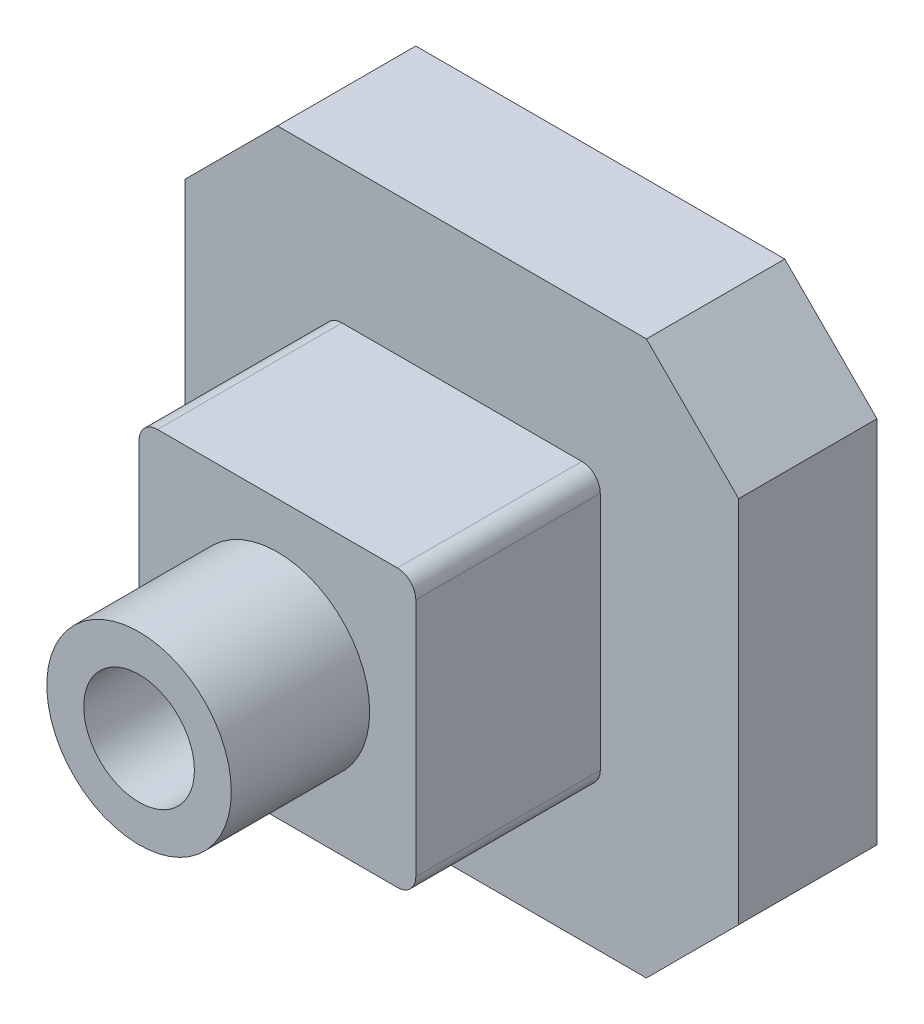
ISO-10303-21;
HEADER;
FILE_DESCRIPTION(('STEP AP214'),'2;1');
FILE_NAME('part.step','',(''),(''),'','','');
FILE_SCHEMA(('AUTOMOTIVE_DESIGN { 1 0 10303 214 1 1 1 1 }'));
ENDSEC;
DATA;
#1=APPLICATION_CONTEXT('core data for automotive mechanical design processes');
#2=APPLICATION_PROTOCOL_DEFINITION('international standard','automotive_design',2000,#1);
#3=PRODUCT_CONTEXT('',#1,'mechanical');
#4=PRODUCT('Part','Part','',(#3));
#5=PRODUCT_RELATED_PRODUCT_CATEGORY('part','',(#4));
#6=PRODUCT_DEFINITION_FORMATION('','',#4);
#7=PRODUCT_DEFINITION_CONTEXT('part definition',#1,'design');
#8=PRODUCT_DEFINITION('design','',#6,#7);
#9=PRODUCT_DEFINITION_SHAPE('','',#8);
#10=(LENGTH_UNIT() NAMED_UNIT(*) SI_UNIT(.MILLI.,.METRE.));
#11=(NAMED_UNIT(*) PLANE_ANGLE_UNIT() SI_UNIT($,.RADIAN.));
#12=(NAMED_UNIT(*) SI_UNIT($,.STERADIAN.) SOLID_ANGLE_UNIT());
#13=UNCERTAINTY_MEASURE_WITH_UNIT(LENGTH_MEASURE(1.E-05),#10,'distance_accuracy_value','');
#14=(GEOMETRIC_REPRESENTATION_CONTEXT(3) GLOBAL_UNCERTAINTY_ASSIGNED_CONTEXT((#13)) GLOBAL_UNIT_ASSIGNED_CONTEXT((#10,
#11,#12)) REPRESENTATION_CONTEXT('',''));
#15=CARTESIAN_POINT('',(0.,0.,0.));
#16=DIRECTION('',(0.,0.,1.));
#17=DIRECTION('',(1.,0.,0.));
#18=AXIS2_PLACEMENT_3D('',#15,#16,#17);
#19=CARTESIAN_POINT('',(0.,0.,0.));
#20=DIRECTION('',(0.,0.,1.));
#21=DIRECTION('',(1.,0.,0.));
#22=AXIS2_PLACEMENT_3D('',#19,#20,#21);
#23=PLANE('',#22);
#24=CARTESIAN_POINT('',(0.,0.,0.));
#25=DIRECTION('',(0.,0.,1.));
#26=DIRECTION('',(1.,0.,0.));
#27=AXIS2_PLACEMENT_3D('',#24,#25,#26);
#28=CIRCLE('',#27,6.);
#29=CARTESIAN_POINT('',(6.,0.,0.));
#30=VERTEX_POINT('',#29);
#31=EDGE_CURVE('E330',#30,#30,#28,.T.);
#32=ORIENTED_EDGE('',*,*,#31,.T.);
#33=EDGE_LOOP('',(#32));
#34=FACE_BOUND('',#33,.T.);
#35=CARTESIAN_POINT('',(0.,0.,0.));
#36=DIRECTION('',(0.,0.,1.));
#37=DIRECTION('',(1.,0.,0.));
#38=AXIS2_PLACEMENT_3D('',#35,#36,#37);
#39=CIRCLE('',#38,9.);
#40=CARTESIAN_POINT('',(9.,0.,0.));
#41=VERTEX_POINT('',#40);
#42=EDGE_CURVE('E323',#41,#41,#39,.T.);
#43=ORIENTED_EDGE('',*,*,#42,.F.);
#44=EDGE_LOOP('',(#43));
#45=FACE_BOUND('',#44,.T.);
#46=ADVANCED_FACE('F51',(#34,#45),#23,.F.);
#47=CARTESIAN_POINT('',(-4.92661467177413E-13,0.,14.9999999999999));
#48=DIRECTION('',(0.,0.,1.));
#49=DIRECTION('',(1.,0.,0.));
#50=AXIS2_PLACEMENT_3D('',#47,#48,#49);
#51=PLANE('',#50);
#52=DIRECTION('',(0.,1.,0.));
#53=VECTOR('',#52,1.);
#54=CARTESIAN_POINT('',(30.,30.,14.9999999999999));
#55=LINE('',#54,#53);
#56=CARTESIAN_POINT('',(30.,-20.,14.9999999999999));
#57=VERTEX_POINT('',#56);
#58=CARTESIAN_POINT('',(30.,19.9999999999999,14.9999999999999));
#59=VERTEX_POINT('',#58);
#60=EDGE_CURVE('E365',#57,#59,#55,.T.);
#61=ORIENTED_EDGE('',*,*,#60,.T.);
#62=DIRECTION('',(0.707106781186546,-0.707106781186549,0.));
#63=VECTOR('',#62,1.);
#64=CARTESIAN_POINT('',(25.,24.9999999999999,14.9999999999999));
#65=LINE('',#64,#63);
#66=CARTESIAN_POINT('',(19.9999999999999,30.,15.));
#67=VERTEX_POINT('',#66);
#68=EDGE_CURVE('E412',#59,#67,#65,.F.);
#69=ORIENTED_EDGE('',*,*,#68,.T.);
#70=DIRECTION('',(-1.,0.,0.));
#71=VECTOR('',#70,1.);
#72=CARTESIAN_POINT('',(-29.9999999999998,30.,14.9999999999999));
#73=LINE('',#72,#71);
#74=CARTESIAN_POINT('',(-20.,30.,15.));
#75=VERTEX_POINT('',#74);
#76=EDGE_CURVE('E368',#67,#75,#73,.T.);
#77=ORIENTED_EDGE('',*,*,#76,.T.);
#78=DIRECTION('',(0.707106781186549,0.707106781186546,0.));
#79=VECTOR('',#78,1.);
#80=CARTESIAN_POINT('',(-24.9999999999999,25.,14.9999999999999));
#81=LINE('',#80,#79);
#82=CARTESIAN_POINT('',(-30.,20.,15.));
#83=VERTEX_POINT('',#82);
#84=EDGE_CURVE('E406',#75,#83,#81,.F.);
#85=ORIENTED_EDGE('',*,*,#84,.T.);
#86=DIRECTION('',(0.,-1.,0.));
#87=VECTOR('',#86,1.);
#88=CARTESIAN_POINT('',(-29.9999999999998,30.,14.9999999999999));
#89=LINE('',#88,#87);
#90=CARTESIAN_POINT('',(-30.,-20.,14.9999999999999));
#91=VERTEX_POINT('',#90);
#92=EDGE_CURVE('E372',#83,#91,#89,.T.);
#93=ORIENTED_EDGE('',*,*,#92,.T.);
#94=DIRECTION('',(-0.707106781186546,0.707106781186549,0.));
#95=VECTOR('',#94,1.);
#96=CARTESIAN_POINT('',(-25.,-24.9999999999999,14.9999999999999));
#97=LINE('',#96,#95);
#98=CARTESIAN_POINT('',(-20.0000000000003,-30.,14.9999999999999));
#99=VERTEX_POINT('',#98);
#100=EDGE_CURVE('E408',#91,#99,#97,.F.);
#101=ORIENTED_EDGE('',*,*,#100,.T.);
#102=DIRECTION('',(1.,0.,0.));
#103=VECTOR('',#102,1.);
#104=CARTESIAN_POINT('',(-30.,-30.,14.9999999999999));
#105=LINE('',#104,#103);
#106=CARTESIAN_POINT('',(19.9999999999999,-30.,14.9999999999999));
#107=VERTEX_POINT('',#106);
#108=EDGE_CURVE('E375',#99,#107,#105,.T.);
#109=ORIENTED_EDGE('',*,*,#108,.T.);
#110=DIRECTION('',(-0.707106781186549,-0.707106781186546,0.));
#111=VECTOR('',#110,1.);
#112=CARTESIAN_POINT('',(25.,-25.,14.9999999999999));
#113=LINE('',#112,#111);
#114=EDGE_CURVE('E410',#107,#57,#113,.F.);
#115=ORIENTED_EDGE('',*,*,#114,.T.);
#116=EDGE_LOOP('',(#61,#69,#77,#85,#93,#101,#109,#115));
#117=FACE_BOUND('',#116,.T.);
#118=DIRECTION('',(-1.,0.,0.));
#119=VECTOR('',#118,1.);
#120=CARTESIAN_POINT('',(-15.,15.,15.));
#121=LINE('',#120,#119);
#122=CARTESIAN_POINT('',(13.,15.,15.));
#123=VERTEX_POINT('',#122);
#124=CARTESIAN_POINT('',(-13.,15.,14.9999999999999));
#125=VERTEX_POINT('',#124);
#126=EDGE_CURVE('E358',#123,#125,#121,.T.);
#127=ORIENTED_EDGE('',*,*,#126,.F.);
#128=CARTESIAN_POINT('',(13.,13.,15.));
#129=DIRECTION('',(0.,0.,1.));
#130=DIRECTION('',(1.,0.,0.));
#131=AXIS2_PLACEMENT_3D('',#128,#129,#130);
#132=CIRCLE('',#131,2.);
#133=CARTESIAN_POINT('',(15.,13.,14.9999999999999));
#134=VERTEX_POINT('',#133);
#135=EDGE_CURVE('E454',#123,#134,#132,.F.);
#136=ORIENTED_EDGE('',*,*,#135,.T.);
#137=DIRECTION('',(0.,1.,0.));
#138=VECTOR('',#137,1.);
#139=CARTESIAN_POINT('',(15.,15.,14.9999999999999));
#140=LINE('',#139,#138);
#141=CARTESIAN_POINT('',(15.,-13.,14.9999999999999));
#142=VERTEX_POINT('',#141);
#143=EDGE_CURVE('E339',#142,#134,#140,.T.);
#144=ORIENTED_EDGE('',*,*,#143,.F.);
#145=CARTESIAN_POINT('',(13.,-13.,14.9999999999999));
#146=DIRECTION('',(0.,0.,1.));
#147=DIRECTION('',(1.,0.,0.));
#148=AXIS2_PLACEMENT_3D('',#145,#146,#147);
#149=CIRCLE('',#148,2.);
#150=CARTESIAN_POINT('',(13.,-15.,15.));
#151=VERTEX_POINT('',#150);
#152=EDGE_CURVE('E452',#142,#151,#149,.F.);
#153=ORIENTED_EDGE('',*,*,#152,.T.);
#154=DIRECTION('',(1.,0.,0.));
#155=VECTOR('',#154,1.);
#156=CARTESIAN_POINT('',(-15.,-15.,15.));
#157=LINE('',#156,#155);
#158=CARTESIAN_POINT('',(-13.,-15.,14.9999999999999));
#159=VERTEX_POINT('',#158);
#160=EDGE_CURVE('E346',#159,#151,#157,.T.);
#161=ORIENTED_EDGE('',*,*,#160,.F.);
#162=CARTESIAN_POINT('',(-13.,-13.,14.9999999999999));
#163=DIRECTION('',(0.,0.,1.));
#164=DIRECTION('',(1.,0.,0.));
#165=AXIS2_PLACEMENT_3D('',#162,#163,#164);
#166=CIRCLE('',#165,2.);
#167=CARTESIAN_POINT('',(-15.,-13.,15.));
#168=VERTEX_POINT('',#167);
#169=EDGE_CURVE('E13',#159,#168,#166,.F.);
#170=ORIENTED_EDGE('',*,*,#169,.T.);
#171=DIRECTION('',(0.,-1.,0.));
#172=VECTOR('',#171,1.);
#173=CARTESIAN_POINT('',(-15.,15.,15.));
#174=LINE('',#173,#172);
#175=CARTESIAN_POINT('',(-15.0000000000002,13.,14.9999999999999));
#176=VERTEX_POINT('',#175);
#177=EDGE_CURVE('E361',#176,#168,#174,.T.);
#178=ORIENTED_EDGE('',*,*,#177,.F.);
#179=CARTESIAN_POINT('',(-13.0000000000002,13.,15.));
#180=DIRECTION('',(0.,0.,1.));
#181=DIRECTION('',(1.,0.,0.));
#182=AXIS2_PLACEMENT_3D('',#179,#180,#181);
#183=CIRCLE('',#182,2.);
#184=EDGE_CURVE('E59',#176,#125,#183,.F.);
#185=ORIENTED_EDGE('',*,*,#184,.T.);
#186=EDGE_LOOP('',(#127,#136,#144,#153,#161,#170,#178,#185));
#187=FACE_BOUND('',#186,.T.);
#188=ADVANCED_FACE('F456',(#117,#187),#51,.T.);
#189=CARTESIAN_POINT('',(30.,30.,14.9999999999999));
#190=DIRECTION('',(-1.,0.,0.));
#191=DIRECTION('',(0.,-1.,0.));
#192=AXIS2_PLACEMENT_3D('',#189,#190,#191);
#193=PLANE('',#192);
#194=DIRECTION('',(0.,1.,0.));
#195=VECTOR('',#194,1.);
#196=CARTESIAN_POINT('',(30.,30.,-2.46330733588707E-13));
#197=LINE('',#196,#195);
#198=CARTESIAN_POINT('',(29.999999999999,-20.,-2.46330733588707E-13));
#199=VERTEX_POINT('',#198);
#200=CARTESIAN_POINT('',(30.,19.9999999999999,0.));
#201=VERTEX_POINT('',#200);
#202=EDGE_CURVE('E355',#199,#201,#197,.T.);
#203=ORIENTED_EDGE('',*,*,#202,.T.);
#204=DIRECTION('',(0.,0.,1.));
#205=VECTOR('',#204,1.);
#206=CARTESIAN_POINT('',(30.,19.9999999999999,14.9999999999999));
#207=LINE('',#206,#205);
#208=EDGE_CURVE('E404',#201,#59,#207,.T.);
#209=ORIENTED_EDGE('',*,*,#208,.T.);
#210=ORIENTED_EDGE('',*,*,#60,.F.);
#211=DIRECTION('',(0.,0.,-1.));
#212=VECTOR('',#211,1.);
#213=CARTESIAN_POINT('',(30.,-20.,14.9999999999999));
#214=LINE('',#213,#212);
#215=EDGE_CURVE('E401',#57,#199,#214,.T.);
#216=ORIENTED_EDGE('',*,*,#215,.T.);
#217=EDGE_LOOP('',(#203,#209,#210,#216));
#218=FACE_BOUND('',#217,.T.);
#219=ADVANCED_FACE('F506',(#218),#193,.F.);
#220=CARTESIAN_POINT('',(-29.9999999999998,30.,14.9999999999999));
#221=DIRECTION('',(0.,-1.,0.));
#222=DIRECTION('',(0.,0.,-1.));
#223=AXIS2_PLACEMENT_3D('',#220,#221,#222);
#224=PLANE('',#223);
#225=ORIENTED_EDGE('',*,*,#76,.F.);
#226=DIRECTION('',(0.,0.,-1.));
#227=VECTOR('',#226,1.);
#228=CARTESIAN_POINT('',(20.,30.,15.));
#229=LINE('',#228,#227);
#230=CARTESIAN_POINT('',(20.0000000000004,30.,0.));
#231=VERTEX_POINT('',#230);
#232=EDGE_CURVE('E390',#67,#231,#229,.T.);
#233=ORIENTED_EDGE('',*,*,#232,.T.);
#234=DIRECTION('',(-1.,0.,0.));
#235=VECTOR('',#234,1.);
#236=CARTESIAN_POINT('',(-30.,30.,0.));
#237=LINE('',#236,#235);
#238=CARTESIAN_POINT('',(-20.,30.,-2.46330733588707E-13));
#239=VERTEX_POINT('',#238);
#240=EDGE_CURVE('E381',#231,#239,#237,.T.);
#241=ORIENTED_EDGE('',*,*,#240,.T.);
#242=DIRECTION('',(0.,0.,1.));
#243=VECTOR('',#242,1.);
#244=CARTESIAN_POINT('',(-20.,30.,15.));
#245=LINE('',#244,#243);
#246=EDGE_CURVE('E378',#239,#75,#245,.T.);
#247=ORIENTED_EDGE('',*,*,#246,.T.);
#248=EDGE_LOOP('',(#225,#233,#241,#247));
#249=FACE_BOUND('',#248,.T.);
#250=ADVANCED_FACE('F528',(#249),#224,.F.);
#251=CARTESIAN_POINT('',(-29.9999999999998,30.,14.9999999999999));
#252=DIRECTION('',(1.,0.,0.));
#253=DIRECTION('',(0.,1.,0.));
#254=AXIS2_PLACEMENT_3D('',#251,#252,#253);
#255=PLANE('',#254);
#256=DIRECTION('',(0.,-1.,0.));
#257=VECTOR('',#256,1.);
#258=CARTESIAN_POINT('',(-30.,30.,0.));
#259=LINE('',#258,#257);
#260=CARTESIAN_POINT('',(-30.,20.,0.));
#261=VERTEX_POINT('',#260);
#262=CARTESIAN_POINT('',(-30.,-20.,-2.46330733588707E-13));
#263=VERTEX_POINT('',#262);
#264=EDGE_CURVE('E384',#261,#263,#259,.T.);
#265=ORIENTED_EDGE('',*,*,#264,.T.);
#266=DIRECTION('',(0.,0.,1.));
#267=VECTOR('',#266,1.);
#268=CARTESIAN_POINT('',(-30.,-20.,14.9999999999999));
#269=LINE('',#268,#267);
#270=EDGE_CURVE('E422',#263,#91,#269,.T.);
#271=ORIENTED_EDGE('',*,*,#270,.T.);
#272=ORIENTED_EDGE('',*,*,#92,.F.);
#273=DIRECTION('',(0.,0.,-1.));
#274=VECTOR('',#273,1.);
#275=CARTESIAN_POINT('',(-30.,20.,15.));
#276=LINE('',#275,#274);
#277=EDGE_CURVE('E419',#83,#261,#276,.T.);
#278=ORIENTED_EDGE('',*,*,#277,.T.);
#279=EDGE_LOOP('',(#265,#271,#272,#278));
#280=FACE_BOUND('',#279,.T.);
#281=ADVANCED_FACE('F519',(#280),#255,.F.);
#282=CARTESIAN_POINT('',(-30.,-30.,14.9999999999999));
#283=DIRECTION('',(0.,1.,0.));
#284=DIRECTION('',(0.,0.,1.));
#285=AXIS2_PLACEMENT_3D('',#282,#283,#284);
#286=PLANE('',#285);
#287=DIRECTION('',(1.,0.,0.));
#288=VECTOR('',#287,1.);
#289=CARTESIAN_POINT('',(-30.,-30.,0.));
#290=LINE('',#289,#288);
#291=CARTESIAN_POINT('',(-20.0000000000003,-30.,-2.46330733588707E-13));
#292=VERTEX_POINT('',#291);
#293=CARTESIAN_POINT('',(19.9999999999999,-30.,0.));
#294=VERTEX_POINT('',#293);
#295=EDGE_CURVE('E369',#292,#294,#290,.T.);
#296=ORIENTED_EDGE('',*,*,#295,.T.);
#297=DIRECTION('',(0.,0.,1.));
#298=VECTOR('',#297,1.);
#299=CARTESIAN_POINT('',(20.,-30.,14.9999999999999));
#300=LINE('',#299,#298);
#301=EDGE_CURVE('E417',#294,#107,#300,.T.);
#302=ORIENTED_EDGE('',*,*,#301,.T.);
#303=ORIENTED_EDGE('',*,*,#108,.F.);
#304=DIRECTION('',(0.,0.,-1.));
#305=VECTOR('',#304,1.);
#306=CARTESIAN_POINT('',(-20.0000000000002,-30.,14.9999999999999));
#307=LINE('',#306,#305);
#308=EDGE_CURVE('E414',#99,#292,#307,.T.);
#309=ORIENTED_EDGE('',*,*,#308,.T.);
#310=EDGE_LOOP('',(#296,#302,#303,#309));
#311=FACE_BOUND('',#310,.T.);
#312=ADVANCED_FACE('F512',(#311),#286,.F.);
#313=DIRECTION('',(-0.707106781186546,0.707106781186549,0.));
#314=VECTOR('',#313,1.);
#315=CARTESIAN_POINT('',(17.8786796564403,27.8786796564404,0.));
#316=LINE('',#315,#314);
#317=CARTESIAN_POINT('',(18.7573593128807,27.,0.));
#318=VERTEX_POINT('',#317);
#319=CARTESIAN_POINT('',(27.,18.7573593128807,0.));
#320=VERTEX_POINT('',#319);
#321=EDGE_CURVE('E315',#318,#320,#316,.F.);
#322=ORIENTED_EDGE('',*,*,#321,.F.);
#323=DIRECTION('',(-1.,0.,0.));
#324=VECTOR('',#323,1.);
#325=CARTESIAN_POINT('',(-30.,27.,0.));
#326=LINE('',#325,#324);
#327=CARTESIAN_POINT('',(-18.7573593128807,27.,-2.46330733588707E-13));
#328=VERTEX_POINT('',#327);
#329=EDGE_CURVE('E264',#318,#328,#326,.T.);
#330=ORIENTED_EDGE('',*,*,#329,.T.);
#331=DIRECTION('',(-0.707106781186549,-0.707106781186546,0.));
#332=VECTOR('',#331,1.);
#333=CARTESIAN_POINT('',(-27.8786796564404,17.8786796564403,0.));
#334=LINE('',#333,#332);
#335=CARTESIAN_POINT('',(-27.,18.7573593128807,0.));
#336=VERTEX_POINT('',#335);
#337=EDGE_CURVE('E266',#336,#328,#334,.F.);
#338=ORIENTED_EDGE('',*,*,#337,.F.);
#339=DIRECTION('',(0.,-1.,0.));
#340=VECTOR('',#339,1.);
#341=CARTESIAN_POINT('',(-27.,30.,0.));
#342=LINE('',#341,#340);
#343=CARTESIAN_POINT('',(-27.,-18.7573593128807,-2.46330733588707E-13));
#344=VERTEX_POINT('',#343);
#345=EDGE_CURVE('E66',#336,#344,#342,.T.);
#346=ORIENTED_EDGE('',*,*,#345,.T.);
#347=DIRECTION('',(0.707106781186546,-0.707106781186549,0.));
#348=VECTOR('',#347,1.);
#349=CARTESIAN_POINT('',(-17.8786796564404,-27.8786796564404,-2.46330733588707E-13));
#350=LINE('',#349,#348);
#351=CARTESIAN_POINT('',(-18.7573593128807,-27.,-2.46330733588707E-13));
#352=VERTEX_POINT('',#351);
#353=EDGE_CURVE('E269',#352,#344,#350,.F.);
#354=ORIENTED_EDGE('',*,*,#353,.F.);
#355=DIRECTION('',(1.,0.,0.));
#356=VECTOR('',#355,1.);
#357=CARTESIAN_POINT('',(-30.,-27.,0.));
#358=LINE('',#357,#356);
#359=CARTESIAN_POINT('',(18.7573593128807,-27.,0.));
#360=VERTEX_POINT('',#359);
#361=EDGE_CURVE('E316',#352,#360,#358,.T.);
#362=ORIENTED_EDGE('',*,*,#361,.T.);
#363=DIRECTION('',(0.707106781186549,0.707106781186546,0.));
#364=VECTOR('',#363,1.);
#365=CARTESIAN_POINT('',(27.8786796564394,-17.8786796564403,-2.46330733588707E-13));
#366=LINE('',#365,#364);
#367=CARTESIAN_POINT('',(26.999999999999,-18.7573593128807,-2.46330733588707E-13));
#368=VERTEX_POINT('',#367);
#369=EDGE_CURVE('E313',#368,#360,#366,.F.);
#370=ORIENTED_EDGE('',*,*,#369,.F.);
#371=DIRECTION('',(0.,1.,0.));
#372=VECTOR('',#371,1.);
#373=CARTESIAN_POINT('',(27.,30.,0.));
#374=LINE('',#373,#372);
#375=EDGE_CURVE('E310',#368,#320,#374,.T.);
#376=ORIENTED_EDGE('',*,*,#375,.T.);
#377=EDGE_LOOP('',(#322,#330,#338,#346,#354,#362,#370,#376));
#378=FACE_BOUND('',#377,.T.);
#379=ORIENTED_EDGE('',*,*,#240,.F.);
#380=DIRECTION('',(-0.707106781186546,0.707106781186549,0.));
#381=VECTOR('',#380,1.);
#382=CARTESIAN_POINT('',(20.0000000000005,30.,0.));
#383=LINE('',#382,#381);
#384=EDGE_CURVE('E399',#231,#201,#383,.F.);
#385=ORIENTED_EDGE('',*,*,#384,.T.);
#386=ORIENTED_EDGE('',*,*,#202,.F.);
#387=DIRECTION('',(0.707106781186549,0.707106781186546,0.));
#388=VECTOR('',#387,1.);
#389=CARTESIAN_POINT('',(29.999999999999,-20.,-2.46330733588707E-13));
#390=LINE('',#389,#388);
#391=EDGE_CURVE('E397',#199,#294,#390,.F.);
#392=ORIENTED_EDGE('',*,*,#391,.T.);
#393=ORIENTED_EDGE('',*,*,#295,.F.);
#394=DIRECTION('',(0.707106781186546,-0.707106781186549,0.));
#395=VECTOR('',#394,1.);
#396=CARTESIAN_POINT('',(-20.0000000000002,-30.,-2.46330733588707E-13));
#397=LINE('',#396,#395);
#398=EDGE_CURVE('E395',#292,#263,#397,.F.);
#399=ORIENTED_EDGE('',*,*,#398,.T.);
#400=ORIENTED_EDGE('',*,*,#264,.F.);
#401=DIRECTION('',(-0.707106781186549,-0.707106781186546,0.));
#402=VECTOR('',#401,1.);
#403=CARTESIAN_POINT('',(-30.,20.,0.));
#404=LINE('',#403,#402);
#405=EDGE_CURVE('E393',#261,#239,#404,.F.);
#406=ORIENTED_EDGE('',*,*,#405,.T.);
#407=EDGE_LOOP('',(#379,#385,#386,#392,#393,#399,#400,#406));
#408=FACE_BOUND('',#407,.T.);
#409=ADVANCED_FACE('F502',(#378,#408),#23,.F.);
#410=CARTESIAN_POINT('',(15.,15.,35.));
#411=DIRECTION('',(-1.,0.,0.));
#412=DIRECTION('',(0.,-1.,0.));
#413=AXIS2_PLACEMENT_3D('',#410,#411,#412);
#414=PLANE('',#413);
#415=DIRECTION('',(0.,1.,0.));
#416=VECTOR('',#415,1.);
#417=CARTESIAN_POINT('',(15.,15.,35.));
#418=LINE('',#417,#416);
#419=CARTESIAN_POINT('',(15.,-13.,35.));
#420=VERTEX_POINT('',#419);
#421=CARTESIAN_POINT('',(15.,13.,35.));
#422=VERTEX_POINT('',#421);
#423=EDGE_CURVE('E342',#420,#422,#418,.T.);
#424=ORIENTED_EDGE('',*,*,#423,.F.);
#425=DIRECTION('',(0.,0.,-1.));
#426=VECTOR('',#425,1.);
#427=CARTESIAN_POINT('',(15.,-13.,35.));
#428=LINE('',#427,#426);
#429=EDGE_CURVE('E426',#420,#142,#428,.T.);
#430=ORIENTED_EDGE('',*,*,#429,.T.);
#431=ORIENTED_EDGE('',*,*,#143,.T.);
#432=DIRECTION('',(0.,0.,-1.));
#433=VECTOR('',#432,1.);
#434=CARTESIAN_POINT('',(15.,13.,35.));
#435=LINE('',#434,#433);
#436=EDGE_CURVE('E424',#134,#422,#435,.F.);
#437=ORIENTED_EDGE('',*,*,#436,.T.);
#438=EDGE_LOOP('',(#424,#430,#431,#437));
#439=FACE_BOUND('',#438,.T.);
#440=ADVANCED_FACE('F486',(#439),#414,.F.);
#441=CARTESIAN_POINT('',(-15.,15.,35.));
#442=DIRECTION('',(0.,-1.,0.));
#443=DIRECTION('',(0.,0.,-1.));
#444=AXIS2_PLACEMENT_3D('',#441,#442,#443);
#445=PLANE('',#444);
#446=DIRECTION('',(-1.,0.,0.));
#447=VECTOR('',#446,1.);
#448=CARTESIAN_POINT('',(-15.,15.,35.));
#449=LINE('',#448,#447);
#450=CARTESIAN_POINT('',(13.,15.,35.));
#451=VERTEX_POINT('',#450);
#452=CARTESIAN_POINT('',(-13.,15.,35.));
#453=VERTEX_POINT('',#452);
#454=EDGE_CURVE('E345',#451,#453,#449,.T.);
#455=ORIENTED_EDGE('',*,*,#454,.F.);
#456=DIRECTION('',(0.,0.,-1.));
#457=VECTOR('',#456,1.);
#458=CARTESIAN_POINT('',(13.,15.,35.));
#459=LINE('',#458,#457);
#460=EDGE_CURVE('E444',#451,#123,#459,.T.);
#461=ORIENTED_EDGE('',*,*,#460,.T.);
#462=ORIENTED_EDGE('',*,*,#126,.T.);
#463=DIRECTION('',(0.,0.,-1.));
#464=VECTOR('',#463,1.);
#465=CARTESIAN_POINT('',(-13.,15.,35.));
#466=LINE('',#465,#464);
#467=EDGE_CURVE('E442',#125,#453,#466,.F.);
#468=ORIENTED_EDGE('',*,*,#467,.T.);
#469=EDGE_LOOP('',(#455,#461,#462,#468));
#470=FACE_BOUND('',#469,.T.);
#471=ADVANCED_FACE('F462',(#470),#445,.F.);
#472=CARTESIAN_POINT('',(-15.,15.,35.));
#473=DIRECTION('',(1.,0.,0.));
#474=DIRECTION('',(0.,1.,0.));
#475=AXIS2_PLACEMENT_3D('',#472,#473,#474);
#476=PLANE('',#475);
#477=DIRECTION('',(0.,-1.,0.));
#478=VECTOR('',#477,1.);
#479=CARTESIAN_POINT('',(-15.,15.,35.));
#480=LINE('',#479,#478);
#481=CARTESIAN_POINT('',(-15.,13.,35.));
#482=VERTEX_POINT('',#481);
#483=CARTESIAN_POINT('',(-14.9999999999997,-12.9999999999995,34.9999999999995));
#484=VERTEX_POINT('',#483);
#485=EDGE_CURVE('E349',#482,#484,#480,.T.);
#486=ORIENTED_EDGE('',*,*,#485,.F.);
#487=DIRECTION('',(0.,0.,-1.));
#488=VECTOR('',#487,1.);
#489=CARTESIAN_POINT('',(-15.,13.,35.));
#490=LINE('',#489,#488);
#491=EDGE_CURVE('E449',#482,#176,#490,.T.);
#492=ORIENTED_EDGE('',*,*,#491,.T.);
#493=ORIENTED_EDGE('',*,*,#177,.T.);
#494=DIRECTION('',(0.,0.,-1.));
#495=VECTOR('',#494,1.);
#496=CARTESIAN_POINT('',(-14.9999999999997,-12.9999999999995,34.9999999999995));
#497=LINE('',#496,#495);
#498=EDGE_CURVE('E447',#168,#484,#497,.F.);
#499=ORIENTED_EDGE('',*,*,#498,.T.);
#500=EDGE_LOOP('',(#486,#492,#493,#499));
#501=FACE_BOUND('',#500,.T.);
#502=ADVANCED_FACE('F471',(#501),#476,.F.);
#503=CARTESIAN_POINT('',(-15.,-14.9999999999995,34.9999999999995));
#504=DIRECTION('',(0.,1.,0.));
#505=DIRECTION('',(0.,0.,1.));
#506=AXIS2_PLACEMENT_3D('',#503,#504,#505);
#507=PLANE('',#506);
#508=ORIENTED_EDGE('',*,*,#160,.T.);
#509=DIRECTION('',(0.,0.,-1.));
#510=VECTOR('',#509,1.);
#511=CARTESIAN_POINT('',(13.,-15.,35.));
#512=LINE('',#511,#510);
#513=CARTESIAN_POINT('',(13.,-15.,35.));
#514=VERTEX_POINT('',#513);
#515=EDGE_CURVE('E432',#151,#514,#512,.F.);
#516=ORIENTED_EDGE('',*,*,#515,.T.);
#517=DIRECTION('',(1.,0.,0.));
#518=VECTOR('',#517,1.);
#519=CARTESIAN_POINT('',(-15.,-14.9999999999995,34.9999999999995));
#520=LINE('',#519,#518);
#521=CARTESIAN_POINT('',(-13.,-15.,34.9999999999995));
#522=VERTEX_POINT('',#521);
#523=EDGE_CURVE('E352',#522,#514,#520,.T.);
#524=ORIENTED_EDGE('',*,*,#523,.F.);
#525=DIRECTION('',(0.,0.,-1.));
#526=VECTOR('',#525,1.);
#527=CARTESIAN_POINT('',(-13.,-15.,34.9999999999995));
#528=LINE('',#527,#526);
#529=EDGE_CURVE('E429',#522,#159,#528,.T.);
#530=ORIENTED_EDGE('',*,*,#529,.T.);
#531=EDGE_LOOP('',(#508,#516,#524,#530));
#532=FACE_BOUND('',#531,.T.);
#533=ADVANCED_FACE('F478',(#532),#507,.F.);
#534=CARTESIAN_POINT('',(0.,0.,35.));
#535=DIRECTION('',(0.,0.,1.));
#536=DIRECTION('',(1.,0.,0.));
#537=AXIS2_PLACEMENT_3D('',#534,#535,#536);
#538=PLANE('',#537);
#539=CARTESIAN_POINT('',(0.,0.,35.));
#540=DIRECTION('',(0.,0.,1.));
#541=DIRECTION('',(1.,0.,0.));
#542=AXIS2_PLACEMENT_3D('',#539,#540,#541);
#543=CIRCLE('',#542,10.);
#544=CARTESIAN_POINT('',(10.,0.,35.));
#545=VERTEX_POINT('',#544);
#546=EDGE_CURVE('E333',#545,#545,#543,.T.);
#547=ORIENTED_EDGE('',*,*,#546,.F.);
#548=EDGE_LOOP('',(#547));
#549=FACE_BOUND('',#548,.T.);
#550=ORIENTED_EDGE('',*,*,#523,.T.);
#551=CARTESIAN_POINT('',(13.,-13.,35.));
#552=DIRECTION('',(0.,0.,1.));
#553=DIRECTION('',(1.,0.,0.));
#554=AXIS2_PLACEMENT_3D('',#551,#552,#553);
#555=CIRCLE('',#554,2.);
#556=EDGE_CURVE('E440',#514,#420,#555,.T.);
#557=ORIENTED_EDGE('',*,*,#556,.T.);
#558=ORIENTED_EDGE('',*,*,#423,.T.);
#559=CARTESIAN_POINT('',(13.,13.,35.));
#560=DIRECTION('',(0.,0.,1.));
#561=DIRECTION('',(1.,0.,0.));
#562=AXIS2_PLACEMENT_3D('',#559,#560,#561);
#563=CIRCLE('',#562,2.);
#564=EDGE_CURVE('E438',#422,#451,#563,.T.);
#565=ORIENTED_EDGE('',*,*,#564,.T.);
#566=ORIENTED_EDGE('',*,*,#454,.T.);
#567=CARTESIAN_POINT('',(-13.,13.,35.));
#568=DIRECTION('',(0.,0.,1.));
#569=DIRECTION('',(1.,0.,0.));
#570=AXIS2_PLACEMENT_3D('',#567,#568,#569);
#571=CIRCLE('',#570,2.);
#572=EDGE_CURVE('E436',#453,#482,#571,.T.);
#573=ORIENTED_EDGE('',*,*,#572,.T.);
#574=ORIENTED_EDGE('',*,*,#485,.T.);
#575=CARTESIAN_POINT('',(-12.9999999999997,-13.,35.));
#576=DIRECTION('',(0.,0.,1.));
#577=DIRECTION('',(1.,0.,0.));
#578=AXIS2_PLACEMENT_3D('',#575,#576,#577);
#579=CIRCLE('',#578,2.);
#580=EDGE_CURVE('E434',#484,#522,#579,.T.);
#581=ORIENTED_EDGE('',*,*,#580,.T.);
#582=EDGE_LOOP('',(#550,#557,#558,#565,#566,#573,#574,#581));
#583=FACE_BOUND('',#582,.T.);
#584=ADVANCED_FACE('F468',(#549,#583),#538,.T.);
#585=CARTESIAN_POINT('',(0.,0.,50.));
#586=DIRECTION('',(0.,0.,-1.));
#587=DIRECTION('',(-1.,0.,0.));
#588=AXIS2_PLACEMENT_3D('',#585,#586,#587);
#589=CYLINDRICAL_SURFACE('',#588,10.);
#590=CARTESIAN_POINT('',(0.,0.,50.));
#591=DIRECTION('',(0.,0.,1.));
#592=DIRECTION('',(1.,0.,0.));
#593=AXIS2_PLACEMENT_3D('',#590,#591,#592);
#594=CIRCLE('',#593,10.);
#595=CARTESIAN_POINT('',(10.,0.,50.));
#596=VERTEX_POINT('',#595);
#597=EDGE_CURVE('E336',#596,#596,#594,.T.);
#598=ORIENTED_EDGE('',*,*,#597,.F.);
#599=EDGE_LOOP('',(#598));
#600=FACE_BOUND('',#599,.T.);
#601=ORIENTED_EDGE('',*,*,#546,.T.);
#602=EDGE_LOOP('',(#601));
#603=FACE_BOUND('',#602,.T.);
#604=ADVANCED_FACE('F709',(#600,#603),#589,.T.);
#605=CARTESIAN_POINT('',(0.,0.,50.));
#606=DIRECTION('',(0.,0.,1.));
#607=DIRECTION('',(1.,0.,0.));
#608=AXIS2_PLACEMENT_3D('',#605,#606,#607);
#609=PLANE('',#608);
#610=CARTESIAN_POINT('',(0.,0.,50.));
#611=DIRECTION('',(0.,0.,1.));
#612=DIRECTION('',(1.,0.,0.));
#613=AXIS2_PLACEMENT_3D('',#610,#611,#612);
#614=CIRCLE('',#613,6.);
#615=CARTESIAN_POINT('',(6.,0.,50.));
#616=VERTEX_POINT('',#615);
#617=EDGE_CURVE('E329',#616,#616,#614,.T.);
#618=ORIENTED_EDGE('',*,*,#617,.F.);
#619=EDGE_LOOP('',(#618));
#620=FACE_BOUND('',#619,.T.);
#621=ORIENTED_EDGE('',*,*,#597,.T.);
#622=EDGE_LOOP('',(#621));
#623=FACE_BOUND('',#622,.T.);
#624=ADVANCED_FACE('F561',(#620,#623),#609,.T.);
#625=CARTESIAN_POINT('',(0.,0.,0.));
#626=DIRECTION('',(0.,0.,1.));
#627=DIRECTION('',(1.,0.,0.));
#628=AXIS2_PLACEMENT_3D('',#625,#626,#627);
#629=CYLINDRICAL_SURFACE('',#628,6.);
#630=ORIENTED_EDGE('',*,*,#31,.F.);
#631=EDGE_LOOP('',(#630));
#632=FACE_BOUND('',#631,.T.);
#633=ORIENTED_EDGE('',*,*,#617,.T.);
#634=EDGE_LOOP('',(#633));
#635=FACE_BOUND('',#634,.T.);
#636=ADVANCED_FACE('F554',(#632,#635),#629,.F.);
#637=CARTESIAN_POINT('',(20.,30.,15.));
#638=DIRECTION('',(-0.707106781186549,-0.707106781186546,0.));
#639=DIRECTION('',(0.,0.,-1.));
#640=AXIS2_PLACEMENT_3D('',#637,#638,#639);
#641=PLANE('',#640);
#642=ORIENTED_EDGE('',*,*,#68,.F.);
#643=ORIENTED_EDGE('',*,*,#208,.F.);
#644=ORIENTED_EDGE('',*,*,#384,.F.);
#645=ORIENTED_EDGE('',*,*,#232,.F.);
#646=EDGE_LOOP('',(#642,#643,#644,#645));
#647=FACE_BOUND('',#646,.T.);
#648=ADVANCED_FACE('F552',(#647),#641,.F.);
#649=CARTESIAN_POINT('',(30.,-20.,14.9999999999999));
#650=DIRECTION('',(-0.707106781186546,0.707106781186549,0.));
#651=DIRECTION('',(0.,0.,-1.));
#652=AXIS2_PLACEMENT_3D('',#649,#650,#651);
#653=PLANE('',#652);
#654=ORIENTED_EDGE('',*,*,#114,.F.);
#655=ORIENTED_EDGE('',*,*,#301,.F.);
#656=ORIENTED_EDGE('',*,*,#391,.F.);
#657=ORIENTED_EDGE('',*,*,#215,.F.);
#658=EDGE_LOOP('',(#654,#655,#656,#657));
#659=FACE_BOUND('',#658,.T.);
#660=ADVANCED_FACE('F545',(#659),#653,.F.);
#661=CARTESIAN_POINT('',(-20.0000000000002,-30.,14.9999999999999));
#662=DIRECTION('',(0.707106781186549,0.707106781186546,0.));
#663=DIRECTION('',(0.,0.,-1.));
#664=AXIS2_PLACEMENT_3D('',#661,#662,#663);
#665=PLANE('',#664);
#666=ORIENTED_EDGE('',*,*,#100,.F.);
#667=ORIENTED_EDGE('',*,*,#270,.F.);
#668=ORIENTED_EDGE('',*,*,#398,.F.);
#669=ORIENTED_EDGE('',*,*,#308,.F.);
#670=EDGE_LOOP('',(#666,#667,#668,#669));
#671=FACE_BOUND('',#670,.T.);
#672=ADVANCED_FACE('F538',(#671),#665,.F.);
#673=CARTESIAN_POINT('',(-30.,20.,15.));
#674=DIRECTION('',(0.707106781186546,-0.707106781186549,0.));
#675=DIRECTION('',(0.,0.,-1.));
#676=AXIS2_PLACEMENT_3D('',#673,#674,#675);
#677=PLANE('',#676);
#678=ORIENTED_EDGE('',*,*,#84,.F.);
#679=ORIENTED_EDGE('',*,*,#246,.F.);
#680=ORIENTED_EDGE('',*,*,#405,.F.);
#681=ORIENTED_EDGE('',*,*,#277,.F.);
#682=EDGE_LOOP('',(#678,#679,#680,#681));
#683=FACE_BOUND('',#682,.T.);
#684=ADVANCED_FACE('F497',(#683),#677,.F.);
#685=CARTESIAN_POINT('',(13.,-13.,35.));
#686=DIRECTION('',(0.,0.,-1.));
#687=DIRECTION('',(-1.,0.,0.));
#688=AXIS2_PLACEMENT_3D('',#685,#686,#687);
#689=CYLINDRICAL_SURFACE('',#688,2.);
#690=ORIENTED_EDGE('',*,*,#556,.F.);
#691=ORIENTED_EDGE('',*,*,#515,.F.);
#692=ORIENTED_EDGE('',*,*,#152,.F.);
#693=ORIENTED_EDGE('',*,*,#429,.F.);
#694=EDGE_LOOP('',(#690,#691,#692,#693));
#695=FACE_BOUND('',#694,.T.);
#696=ADVANCED_FACE('F481',(#695),#689,.T.);
#697=CARTESIAN_POINT('',(13.,13.,35.));
#698=DIRECTION('',(0.,0.,-1.));
#699=DIRECTION('',(-1.,0.,0.));
#700=AXIS2_PLACEMENT_3D('',#697,#698,#699);
#701=CYLINDRICAL_SURFACE('',#700,2.);
#702=ORIENTED_EDGE('',*,*,#564,.F.);
#703=ORIENTED_EDGE('',*,*,#436,.F.);
#704=ORIENTED_EDGE('',*,*,#135,.F.);
#705=ORIENTED_EDGE('',*,*,#460,.F.);
#706=EDGE_LOOP('',(#702,#703,#704,#705));
#707=FACE_BOUND('',#706,.T.);
#708=ADVANCED_FACE('F490',(#707),#701,.T.);
#709=CARTESIAN_POINT('',(-13.,13.,35.));
#710=DIRECTION('',(0.,0.,-1.));
#711=DIRECTION('',(-1.,0.,0.));
#712=AXIS2_PLACEMENT_3D('',#709,#710,#711);
#713=CYLINDRICAL_SURFACE('',#712,2.);
#714=ORIENTED_EDGE('',*,*,#572,.F.);
#715=ORIENTED_EDGE('',*,*,#467,.F.);
#716=ORIENTED_EDGE('',*,*,#184,.F.);
#717=ORIENTED_EDGE('',*,*,#491,.F.);
#718=EDGE_LOOP('',(#714,#715,#716,#717));
#719=FACE_BOUND('',#718,.T.);
#720=ADVANCED_FACE('F465',(#719),#713,.T.);
#721=CARTESIAN_POINT('',(-12.9999999999997,-13.,35.));
#722=DIRECTION('',(0.,0.,-1.));
#723=DIRECTION('',(-1.,0.,0.));
#724=AXIS2_PLACEMENT_3D('',#721,#722,#723);
#725=CYLINDRICAL_SURFACE('',#724,2.);
#726=ORIENTED_EDGE('',*,*,#580,.F.);
#727=ORIENTED_EDGE('',*,*,#498,.F.);
#728=ORIENTED_EDGE('',*,*,#169,.F.);
#729=ORIENTED_EDGE('',*,*,#529,.F.);
#730=EDGE_LOOP('',(#726,#727,#728,#729));
#731=FACE_BOUND('',#730,.T.);
#732=ADVANCED_FACE('F53',(#731),#725,.T.);
#733=CARTESIAN_POINT('',(0.,0.,32.));
#734=DIRECTION('',(0.,0.,1.));
#735=DIRECTION('',(1.,0.,0.));
#736=AXIS2_PLACEMENT_3D('',#733,#734,#735);
#737=PLANE('',#736);
#738=DIRECTION('',(1.,0.,0.));
#739=VECTOR('',#738,1.);
#740=CARTESIAN_POINT('',(-15.,-11.9999999999995,31.9999999999995));
#741=LINE('',#740,#739);
#742=CARTESIAN_POINT('',(-12.,-12.,32.));
#743=VERTEX_POINT('',#742);
#744=CARTESIAN_POINT('',(12.,-12.,32.));
#745=VERTEX_POINT('',#744);
#746=EDGE_CURVE('E304',#743,#745,#741,.T.);
#747=ORIENTED_EDGE('',*,*,#746,.F.);
#748=DIRECTION('',(0.,-1.,0.));
#749=VECTOR('',#748,1.);
#750=CARTESIAN_POINT('',(-12.,15.,32.));
#751=LINE('',#750,#749);
#752=CARTESIAN_POINT('',(-12.,12.,32.));
#753=VERTEX_POINT('',#752);
#754=EDGE_CURVE('E298',#753,#743,#751,.T.);
#755=ORIENTED_EDGE('',*,*,#754,.F.);
#756=DIRECTION('',(-1.,0.,0.));
#757=VECTOR('',#756,1.);
#758=CARTESIAN_POINT('',(-15.,12.,32.));
#759=LINE('',#758,#757);
#760=CARTESIAN_POINT('',(12.,12.,32.));
#761=VERTEX_POINT('',#760);
#762=EDGE_CURVE('E288',#761,#753,#759,.T.);
#763=ORIENTED_EDGE('',*,*,#762,.F.);
#764=DIRECTION('',(0.,1.,0.));
#765=VECTOR('',#764,1.);
#766=CARTESIAN_POINT('',(12.,15.,32.));
#767=LINE('',#766,#765);
#768=EDGE_CURVE('E285',#745,#761,#767,.T.);
#769=ORIENTED_EDGE('',*,*,#768,.F.);
#770=EDGE_LOOP('',(#747,#755,#763,#769));
#771=FACE_BOUND('',#770,.T.);
#772=CARTESIAN_POINT('',(0.,0.,32.));
#773=DIRECTION('',(0.,0.,1.));
#774=DIRECTION('',(1.,0.,0.));
#775=AXIS2_PLACEMENT_3D('',#772,#773,#774);
#776=CIRCLE('',#775,9.);
#777=CARTESIAN_POINT('',(9.,0.,32.));
#778=VERTEX_POINT('',#777);
#779=EDGE_CURVE('E307',#778,#778,#776,.F.);
#780=ORIENTED_EDGE('',*,*,#779,.F.);
#781=EDGE_LOOP('',(#780));
#782=FACE_BOUND('',#781,.T.);
#783=ADVANCED_FACE('F590',(#771,#782),#737,.F.);
#784=CARTESIAN_POINT('',(-4.92661467177413E-13,0.,11.9999999999999));
#785=DIRECTION('',(0.,0.,1.));
#786=DIRECTION('',(1.,0.,0.));
#787=AXIS2_PLACEMENT_3D('',#784,#785,#786);
#788=PLANE('',#787);
#789=DIRECTION('',(0.,1.,0.));
#790=VECTOR('',#789,1.);
#791=CARTESIAN_POINT('',(27.,30.,11.9999999999999));
#792=LINE('',#791,#790);
#793=CARTESIAN_POINT('',(26.999999999999,-18.7573593128807,12.));
#794=VERTEX_POINT('',#793);
#795=CARTESIAN_POINT('',(27.,18.7573593128807,11.9999999999999));
#796=VERTEX_POINT('',#795);
#797=EDGE_CURVE('E260',#794,#796,#792,.T.);
#798=ORIENTED_EDGE('',*,*,#797,.F.);
#799=DIRECTION('',(-0.707106781186549,-0.707106781186546,0.));
#800=VECTOR('',#799,1.);
#801=CARTESIAN_POINT('',(22.8786796564403,-22.8786796564404,11.9999999999999));
#802=LINE('',#801,#800);
#803=CARTESIAN_POINT('',(18.7573593128807,-27.,11.9999999999999));
#804=VERTEX_POINT('',#803);
#805=EDGE_CURVE('E248',#804,#794,#802,.F.);
#806=ORIENTED_EDGE('',*,*,#805,.F.);
#807=DIRECTION('',(1.,0.,0.));
#808=VECTOR('',#807,1.);
#809=CARTESIAN_POINT('',(-30.,-27.,11.9999999999999));
#810=LINE('',#809,#808);
#811=CARTESIAN_POINT('',(-18.7573593128807,-27.,11.9999999999999));
#812=VERTEX_POINT('',#811);
#813=EDGE_CURVE('E271',#812,#804,#810,.T.);
#814=ORIENTED_EDGE('',*,*,#813,.F.);
#815=DIRECTION('',(-0.707106781186546,0.707106781186549,0.));
#816=VECTOR('',#815,1.);
#817=CARTESIAN_POINT('',(-22.8786796564404,-22.8786796564403,11.9999999999999));
#818=LINE('',#817,#816);
#819=CARTESIAN_POINT('',(-27.,-18.7573593128807,12.));
#820=VERTEX_POINT('',#819);
#821=EDGE_CURVE('E795',#820,#812,#818,.F.);
#822=ORIENTED_EDGE('',*,*,#821,.F.);
#823=DIRECTION('',(0.,-1.,0.));
#824=VECTOR('',#823,1.);
#825=CARTESIAN_POINT('',(-27.,30.,11.9999999999999));
#826=LINE('',#825,#824);
#827=CARTESIAN_POINT('',(-27.,18.7573593128807,11.9999999999999));
#828=VERTEX_POINT('',#827);
#829=EDGE_CURVE('E259',#828,#820,#826,.T.);
#830=ORIENTED_EDGE('',*,*,#829,.F.);
#831=DIRECTION('',(0.707106781186549,0.707106781186546,0.));
#832=VECTOR('',#831,1.);
#833=CARTESIAN_POINT('',(-22.8786796564403,22.8786796564404,11.9999999999999));
#834=LINE('',#833,#832);
#835=CARTESIAN_POINT('',(-18.7573593128807,27.,12.));
#836=VERTEX_POINT('',#835);
#837=EDGE_CURVE('E256',#836,#828,#834,.F.);
#838=ORIENTED_EDGE('',*,*,#837,.F.);
#839=DIRECTION('',(-1.,0.,0.));
#840=VECTOR('',#839,1.);
#841=CARTESIAN_POINT('',(-30.0000000000003,27.,11.9999999999999));
#842=LINE('',#841,#840);
#843=CARTESIAN_POINT('',(18.7573593128807,27.,11.9999999999999));
#844=VERTEX_POINT('',#843);
#845=EDGE_CURVE('E252',#844,#836,#842,.T.);
#846=ORIENTED_EDGE('',*,*,#845,.F.);
#847=DIRECTION('',(0.707106781186546,-0.707106781186549,0.));
#848=VECTOR('',#847,1.);
#849=CARTESIAN_POINT('',(22.8786796564404,22.8786796564403,12.));
#850=LINE('',#849,#848);
#851=EDGE_CURVE('E236',#796,#844,#850,.F.);
#852=ORIENTED_EDGE('',*,*,#851,.F.);
#853=EDGE_LOOP('',(#798,#806,#814,#822,#830,#838,#846,#852));
#854=FACE_BOUND('',#853,.T.);
#855=DIRECTION('',(-1.,0.,0.));
#856=VECTOR('',#855,1.);
#857=CARTESIAN_POINT('',(-15.,12.,11.9999999999999));
#858=LINE('',#857,#856);
#859=CARTESIAN_POINT('',(12.,12.,11.9999999999999));
#860=VERTEX_POINT('',#859);
#861=CARTESIAN_POINT('',(-12.,12.,12.));
#862=VERTEX_POINT('',#861);
#863=EDGE_CURVE('E806',#860,#862,#858,.T.);
#864=ORIENTED_EDGE('',*,*,#863,.T.);
#865=DIRECTION('',(0.,-1.,0.));
#866=VECTOR('',#865,1.);
#867=CARTESIAN_POINT('',(-12.,15.,11.9999999999999));
#868=LINE('',#867,#866);
#869=CARTESIAN_POINT('',(-12.,-12.,11.9999999999999));
#870=VERTEX_POINT('',#869);
#871=EDGE_CURVE('E808',#862,#870,#868,.T.);
#872=ORIENTED_EDGE('',*,*,#871,.T.);
#873=DIRECTION('',(1.,0.,0.));
#874=VECTOR('',#873,1.);
#875=CARTESIAN_POINT('',(-15.,-12.,12.));
#876=LINE('',#875,#874);
#877=CARTESIAN_POINT('',(12.,-12.,11.9999999999999));
#878=VERTEX_POINT('',#877);
#879=EDGE_CURVE('E289',#870,#878,#876,.T.);
#880=ORIENTED_EDGE('',*,*,#879,.T.);
#881=DIRECTION('',(0.,1.,0.));
#882=VECTOR('',#881,1.);
#883=CARTESIAN_POINT('',(12.,15.,12.));
#884=LINE('',#883,#882);
#885=EDGE_CURVE('E326',#878,#860,#884,.T.);
#886=ORIENTED_EDGE('',*,*,#885,.T.);
#887=EDGE_LOOP('',(#864,#872,#880,#886));
#888=FACE_BOUND('',#887,.T.);
#889=ADVANCED_FACE('F253',(#854,#888),#788,.F.);
#890=CARTESIAN_POINT('',(27.,30.,14.9999999999999));
#891=DIRECTION('',(-1.,0.,0.));
#892=DIRECTION('',(0.,-1.,0.));
#893=AXIS2_PLACEMENT_3D('',#890,#891,#892);
#894=PLANE('',#893);
#895=ORIENTED_EDGE('',*,*,#375,.F.);
#896=DIRECTION('',(0.,0.,1.));
#897=VECTOR('',#896,1.);
#898=CARTESIAN_POINT('',(27.,-18.7573593128807,15.));
#899=LINE('',#898,#897);
#900=EDGE_CURVE('E274',#794,#368,#899,.F.);
#901=ORIENTED_EDGE('',*,*,#900,.F.);
#902=ORIENTED_EDGE('',*,*,#797,.T.);
#903=DIRECTION('',(0.,0.,-1.));
#904=VECTOR('',#903,1.);
#905=CARTESIAN_POINT('',(27.,18.7573593128807,14.9999999999999));
#906=LINE('',#905,#904);
#907=EDGE_CURVE('E243',#320,#796,#906,.F.);
#908=ORIENTED_EDGE('',*,*,#907,.F.);
#909=EDGE_LOOP('',(#895,#901,#902,#908));
#910=FACE_BOUND('',#909,.T.);
#911=ADVANCED_FACE('F600',(#910),#894,.T.);
#912=CARTESIAN_POINT('',(-30.,27.,14.9999999999999));
#913=DIRECTION('',(0.,-1.,0.));
#914=DIRECTION('',(0.,0.,-1.));
#915=AXIS2_PLACEMENT_3D('',#912,#913,#914);
#916=PLANE('',#915);
#917=ORIENTED_EDGE('',*,*,#845,.T.);
#918=DIRECTION('',(0.,0.,-1.));
#919=VECTOR('',#918,1.);
#920=CARTESIAN_POINT('',(-18.7573593128807,27.,15.));
#921=LINE('',#920,#919);
#922=EDGE_CURVE('E267',#328,#836,#921,.F.);
#923=ORIENTED_EDGE('',*,*,#922,.F.);
#924=ORIENTED_EDGE('',*,*,#329,.F.);
#925=DIRECTION('',(0.,0.,1.));
#926=VECTOR('',#925,1.);
#927=CARTESIAN_POINT('',(18.7573593128807,27.,14.9999999999999));
#928=LINE('',#927,#926);
#929=EDGE_CURVE('E240',#844,#318,#928,.F.);
#930=ORIENTED_EDGE('',*,*,#929,.F.);
#931=EDGE_LOOP('',(#917,#923,#924,#930));
#932=FACE_BOUND('',#931,.T.);
#933=ADVANCED_FACE('F262',(#932),#916,.T.);
#934=CARTESIAN_POINT('',(-26.9999999999998,30.,14.9999999999999));
#935=DIRECTION('',(1.,0.,0.));
#936=DIRECTION('',(0.,1.,0.));
#937=AXIS2_PLACEMENT_3D('',#934,#935,#936);
#938=PLANE('',#937);
#939=ORIENTED_EDGE('',*,*,#345,.F.);
#940=DIRECTION('',(0.,0.,1.));
#941=VECTOR('',#940,1.);
#942=CARTESIAN_POINT('',(-27.,18.7573593128807,14.9999999999999));
#943=LINE('',#942,#941);
#944=EDGE_CURVE('E277',#828,#336,#943,.F.);
#945=ORIENTED_EDGE('',*,*,#944,.F.);
#946=ORIENTED_EDGE('',*,*,#829,.T.);
#947=DIRECTION('',(0.,0.,-1.));
#948=VECTOR('',#947,1.);
#949=CARTESIAN_POINT('',(-27.,-18.7573593128807,15.));
#950=LINE('',#949,#948);
#951=EDGE_CURVE('E279',#344,#820,#950,.F.);
#952=ORIENTED_EDGE('',*,*,#951,.F.);
#953=EDGE_LOOP('',(#939,#945,#946,#952));
#954=FACE_BOUND('',#953,.T.);
#955=ADVANCED_FACE('F614',(#954),#938,.T.);
#956=CARTESIAN_POINT('',(-30.,-27.,14.9999999999999));
#957=DIRECTION('',(0.,1.,0.));
#958=DIRECTION('',(0.,0.,1.));
#959=AXIS2_PLACEMENT_3D('',#956,#957,#958);
#960=PLANE('',#959);
#961=ORIENTED_EDGE('',*,*,#361,.F.);
#962=DIRECTION('',(0.,0.,1.));
#963=VECTOR('',#962,1.);
#964=CARTESIAN_POINT('',(-18.7573593128807,-27.,14.9999999999999));
#965=LINE('',#964,#963);
#966=EDGE_CURVE('E247',#812,#352,#965,.F.);
#967=ORIENTED_EDGE('',*,*,#966,.F.);
#968=ORIENTED_EDGE('',*,*,#813,.T.);
#969=DIRECTION('',(0.,0.,-1.));
#970=VECTOR('',#969,1.);
#971=CARTESIAN_POINT('',(18.7573593128807,-27.,14.9999999999999));
#972=LINE('',#971,#970);
#973=EDGE_CURVE('E280',#360,#804,#972,.F.);
#974=ORIENTED_EDGE('',*,*,#973,.F.);
#975=EDGE_LOOP('',(#961,#967,#968,#974));
#976=FACE_BOUND('',#975,.T.);
#977=ADVANCED_FACE('F621',(#976),#960,.T.);
#978=CARTESIAN_POINT('',(12.,15.,35.));
#979=DIRECTION('',(-1.,0.,0.));
#980=DIRECTION('',(0.,-1.,0.));
#981=AXIS2_PLACEMENT_3D('',#978,#979,#980);
#982=PLANE('',#981);
#983=ORIENTED_EDGE('',*,*,#768,.T.);
#984=DIRECTION('',(0.,0.,1.));
#985=VECTOR('',#984,1.);
#986=CARTESIAN_POINT('',(12.,12.,35.));
#987=LINE('',#986,#985);
#988=EDGE_CURVE('E282',#860,#761,#987,.T.);
#989=ORIENTED_EDGE('',*,*,#988,.F.);
#990=ORIENTED_EDGE('',*,*,#885,.F.);
#991=DIRECTION('',(0.,0.,1.));
#992=VECTOR('',#991,1.);
#993=CARTESIAN_POINT('',(12.,-12.,35.));
#994=LINE('',#993,#992);
#995=EDGE_CURVE('E290',#878,#745,#994,.T.);
#996=ORIENTED_EDGE('',*,*,#995,.T.);
#997=EDGE_LOOP('',(#983,#989,#990,#996));
#998=FACE_BOUND('',#997,.T.);
#999=ADVANCED_FACE('F628',(#998),#982,.T.);
#1000=CARTESIAN_POINT('',(-15.,12.,35.));
#1001=DIRECTION('',(0.,-1.,0.));
#1002=DIRECTION('',(0.,0.,-1.));
#1003=AXIS2_PLACEMENT_3D('',#1000,#1001,#1002);
#1004=PLANE('',#1003);
#1005=ORIENTED_EDGE('',*,*,#762,.T.);
#1006=DIRECTION('',(0.,0.,1.));
#1007=VECTOR('',#1006,1.);
#1008=CARTESIAN_POINT('',(-12.,12.,35.));
#1009=LINE('',#1008,#1007);
#1010=EDGE_CURVE('E293',#862,#753,#1009,.T.);
#1011=ORIENTED_EDGE('',*,*,#1010,.F.);
#1012=ORIENTED_EDGE('',*,*,#863,.F.);
#1013=ORIENTED_EDGE('',*,*,#988,.T.);
#1014=EDGE_LOOP('',(#1005,#1011,#1012,#1013));
#1015=FACE_BOUND('',#1014,.T.);
#1016=ADVANCED_FACE('F636',(#1015),#1004,.T.);
#1017=CARTESIAN_POINT('',(-12.,15.,35.));
#1018=DIRECTION('',(1.,0.,0.));
#1019=DIRECTION('',(0.,1.,0.));
#1020=AXIS2_PLACEMENT_3D('',#1017,#1018,#1019);
#1021=PLANE('',#1020);
#1022=ORIENTED_EDGE('',*,*,#754,.T.);
#1023=DIRECTION('',(0.,0.,1.));
#1024=VECTOR('',#1023,1.);
#1025=CARTESIAN_POINT('',(-12.,-12.,35.));
#1026=LINE('',#1025,#1024);
#1027=EDGE_CURVE('E301',#870,#743,#1026,.T.);
#1028=ORIENTED_EDGE('',*,*,#1027,.F.);
#1029=ORIENTED_EDGE('',*,*,#871,.F.);
#1030=ORIENTED_EDGE('',*,*,#1010,.T.);
#1031=EDGE_LOOP('',(#1022,#1028,#1029,#1030));
#1032=FACE_BOUND('',#1031,.T.);
#1033=ADVANCED_FACE('F644',(#1032),#1021,.T.);
#1034=CARTESIAN_POINT('',(-15.,-11.9999999999995,34.9999999999995));
#1035=DIRECTION('',(0.,1.,0.));
#1036=DIRECTION('',(0.,0.,1.));
#1037=AXIS2_PLACEMENT_3D('',#1034,#1035,#1036);
#1038=PLANE('',#1037);
#1039=ORIENTED_EDGE('',*,*,#879,.F.);
#1040=ORIENTED_EDGE('',*,*,#1027,.T.);
#1041=ORIENTED_EDGE('',*,*,#746,.T.);
#1042=ORIENTED_EDGE('',*,*,#995,.F.);
#1043=EDGE_LOOP('',(#1039,#1040,#1041,#1042));
#1044=FACE_BOUND('',#1043,.T.);
#1045=ADVANCED_FACE('F652',(#1044),#1038,.T.);
#1046=CARTESIAN_POINT('',(0.,0.,0.));
#1047=DIRECTION('',(0.,0.,1.));
#1048=DIRECTION('',(1.,0.,0.));
#1049=AXIS2_PLACEMENT_3D('',#1046,#1047,#1048);
#1050=CYLINDRICAL_SURFACE('',#1049,9.);
#1051=ORIENTED_EDGE('',*,*,#779,.T.);
#1052=EDGE_LOOP('',(#1051));
#1053=FACE_BOUND('',#1052,.T.);
#1054=ORIENTED_EDGE('',*,*,#42,.T.);
#1055=EDGE_LOOP('',(#1054));
#1056=FACE_BOUND('',#1055,.T.);
#1057=ADVANCED_FACE('F660',(#1053,#1056),#1050,.T.);
#1058=CARTESIAN_POINT('',(17.8786796564403,27.8786796564404,14.9999999999999));
#1059=DIRECTION('',(-0.707106781186549,-0.707106781186546,0.));
#1060=DIRECTION('',(0.,0.,-1.));
#1061=AXIS2_PLACEMENT_3D('',#1058,#1059,#1060);
#1062=PLANE('',#1061);
#1063=ORIENTED_EDGE('',*,*,#851,.T.);
#1064=ORIENTED_EDGE('',*,*,#929,.T.);
#1065=ORIENTED_EDGE('',*,*,#321,.T.);
#1066=ORIENTED_EDGE('',*,*,#907,.T.);
#1067=EDGE_LOOP('',(#1063,#1064,#1065,#1066));
#1068=FACE_BOUND('',#1067,.T.);
#1069=ADVANCED_FACE('F238',(#1068),#1062,.T.);
#1070=CARTESIAN_POINT('',(27.8786796564403,-17.8786796564403,14.9999999999999));
#1071=DIRECTION('',(-0.707106781186546,0.707106781186549,0.));
#1072=DIRECTION('',(0.,0.,-1.));
#1073=AXIS2_PLACEMENT_3D('',#1070,#1071,#1072);
#1074=PLANE('',#1073);
#1075=ORIENTED_EDGE('',*,*,#805,.T.);
#1076=ORIENTED_EDGE('',*,*,#900,.T.);
#1077=ORIENTED_EDGE('',*,*,#369,.T.);
#1078=ORIENTED_EDGE('',*,*,#973,.T.);
#1079=EDGE_LOOP('',(#1075,#1076,#1077,#1078));
#1080=FACE_BOUND('',#1079,.T.);
#1081=ADVANCED_FACE('F681',(#1080),#1074,.T.);
#1082=CARTESIAN_POINT('',(-17.8786796564404,-27.8786796564404,14.9999999999999));
#1083=DIRECTION('',(0.707106781186549,0.707106781186546,0.));
#1084=DIRECTION('',(0.,0.,-1.));
#1085=AXIS2_PLACEMENT_3D('',#1082,#1083,#1084);
#1086=PLANE('',#1085);
#1087=ORIENTED_EDGE('',*,*,#821,.T.);
#1088=ORIENTED_EDGE('',*,*,#966,.T.);
#1089=ORIENTED_EDGE('',*,*,#353,.T.);
#1090=ORIENTED_EDGE('',*,*,#951,.T.);
#1091=EDGE_LOOP('',(#1087,#1088,#1089,#1090));
#1092=FACE_BOUND('',#1091,.T.);
#1093=ADVANCED_FACE('F688',(#1092),#1086,.T.);
#1094=CARTESIAN_POINT('',(-27.8786796564404,17.8786796564403,15.));
#1095=DIRECTION('',(0.707106781186546,-0.707106781186549,0.));
#1096=DIRECTION('',(0.,0.,-1.));
#1097=AXIS2_PLACEMENT_3D('',#1094,#1095,#1096);
#1098=PLANE('',#1097);
#1099=ORIENTED_EDGE('',*,*,#837,.T.);
#1100=ORIENTED_EDGE('',*,*,#944,.T.);
#1101=ORIENTED_EDGE('',*,*,#337,.T.);
#1102=ORIENTED_EDGE('',*,*,#922,.T.);
#1103=EDGE_LOOP('',(#1099,#1100,#1101,#1102));
#1104=FACE_BOUND('',#1103,.T.);
#1105=ADVANCED_FACE('F696',(#1104),#1098,.T.);
#1106=CLOSED_SHELL('',(#46,#188,#219,#250,#281,#312,#409,#440,#471,#502,#533,#584,#604,#624,
#636,#648,#660,#672,#684,#696,#708,#720,#732,#783,#889,#911,#933,#955,#977,#999,#1016,#1033,
#1045,#1057,#1069,#1081,#1093,#1105));
#1107=MANIFOLD_SOLID_BREP('B2',#1106);
#1108=ADVANCED_BREP_SHAPE_REPRESENTATION('',(#18,#1107),#14);
#1109=SHAPE_DEFINITION_REPRESENTATION(#9,#1108);
ENDSEC;
END-ISO-10303-21;
